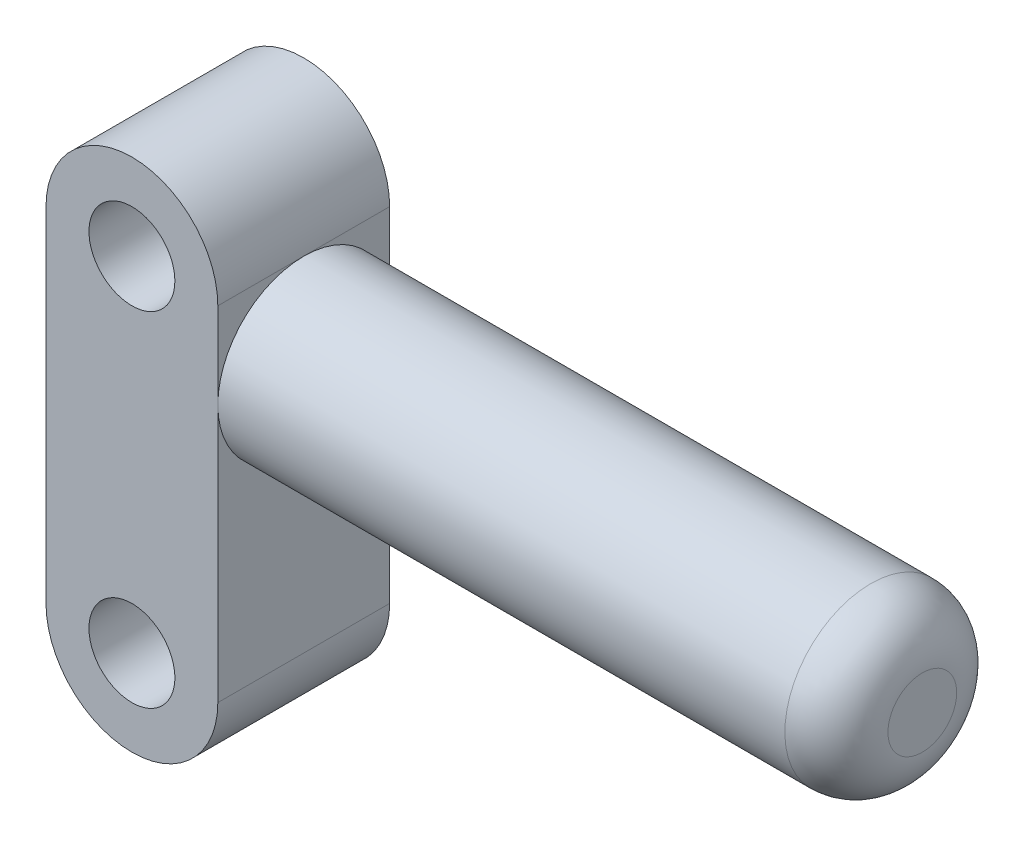
ISO-10303-21;
HEADER;
FILE_DESCRIPTION(('STEP AP214'),'2;1');
FILE_NAME('part.step','',(''),(''),'','','');
FILE_SCHEMA(('AUTOMOTIVE_DESIGN { 1 0 10303 214 1 1 1 1 }'));
ENDSEC;
DATA;
#1=APPLICATION_CONTEXT('core data for automotive mechanical design processes');
#2=APPLICATION_PROTOCOL_DEFINITION('international standard','automotive_design',2000,#1);
#3=PRODUCT_CONTEXT('',#1,'mechanical');
#4=PRODUCT('Part','Part','',(#3));
#5=PRODUCT_RELATED_PRODUCT_CATEGORY('part','',(#4));
#6=PRODUCT_DEFINITION_FORMATION('','',#4);
#7=PRODUCT_DEFINITION_CONTEXT('part definition',#1,'design');
#8=PRODUCT_DEFINITION('design','',#6,#7);
#9=PRODUCT_DEFINITION_SHAPE('','',#8);
#10=(LENGTH_UNIT() NAMED_UNIT(*) SI_UNIT(.MILLI.,.METRE.));
#11=(NAMED_UNIT(*) PLANE_ANGLE_UNIT() SI_UNIT($,.RADIAN.));
#12=(NAMED_UNIT(*) SI_UNIT($,.STERADIAN.) SOLID_ANGLE_UNIT());
#13=UNCERTAINTY_MEASURE_WITH_UNIT(LENGTH_MEASURE(1.E-05),#10,'distance_accuracy_value','');
#14=(GEOMETRIC_REPRESENTATION_CONTEXT(3) GLOBAL_UNCERTAINTY_ASSIGNED_CONTEXT((#13)) GLOBAL_UNIT_ASSIGNED_CONTEXT((#10,
#11,#12)) REPRESENTATION_CONTEXT('',''));
#15=CARTESIAN_POINT('',(0.,0.,0.));
#16=DIRECTION('',(0.,0.,1.));
#17=DIRECTION('',(1.,0.,0.));
#18=AXIS2_PLACEMENT_3D('',#15,#16,#17);
#19=CARTESIAN_POINT('',(5.,10.,5.));
#20=DIRECTION('',(-1.,0.,0.));
#21=DIRECTION('',(0.,-1.,0.));
#22=AXIS2_PLACEMENT_3D('',#19,#20,#21);
#23=PLANE('',#22);
#24=CARTESIAN_POINT('',(5.,5.,0.));
#25=DIRECTION('',(-1.,0.,0.));
#26=DIRECTION('',(0.,-1.,0.));
#27=AXIS2_PLACEMENT_3D('',#24,#25,#26);
#28=CIRCLE('',#27,5.);
#29=CARTESIAN_POINT('',(5.,5.,-5.));
#30=VERTEX_POINT('',#29);
#31=CARTESIAN_POINT('',(5.,10.,0.));
#32=VERTEX_POINT('',#31);
#33=EDGE_CURVE('E107',#30,#32,#28,.F.);
#34=ORIENTED_EDGE('',*,*,#33,.F.);
#35=DIRECTION('',(0.,1.,0.));
#36=VECTOR('',#35,1.);
#37=CARTESIAN_POINT('',(5.,10.,-5.));
#38=LINE('',#37,#36);
#39=CARTESIAN_POINT('',(5.,10.,-5.));
#40=VERTEX_POINT('',#39);
#41=EDGE_CURVE('E95',#30,#40,#38,.T.);
#42=ORIENTED_EDGE('',*,*,#41,.T.);
#43=DIRECTION('',(0.,0.,-1.));
#44=VECTOR('',#43,1.);
#45=CARTESIAN_POINT('',(5.,10.,5.));
#46=LINE('',#45,#44);
#47=EDGE_CURVE('E108',#32,#40,#46,.T.);
#48=ORIENTED_EDGE('',*,*,#47,.F.);
#49=EDGE_LOOP('',(#34,#42,#48));
#50=FACE_BOUND('',#49,.T.);
#51=ADVANCED_FACE('F36',(#50),#23,.F.);
#52=CARTESIAN_POINT('',(5.,5.,0.));
#53=DIRECTION('',(1.,0.,0.));
#54=DIRECTION('',(0.,1.,0.));
#55=AXIS2_PLACEMENT_3D('',#52,#53,#54);
#56=CIRCLE('',#55,5.);
#57=CARTESIAN_POINT('',(5.,5.,5.));
#58=VERTEX_POINT('',#57);
#59=EDGE_CURVE('E58',#32,#58,#56,.T.);
#60=ORIENTED_EDGE('',*,*,#59,.F.);
#61=CARTESIAN_POINT('',(5.,10.,5.));
#62=VERTEX_POINT('',#61);
#63=EDGE_CURVE('E176',#62,#32,#46,.T.);
#64=ORIENTED_EDGE('',*,*,#63,.F.);
#65=DIRECTION('',(0.,1.,0.));
#66=VECTOR('',#65,1.);
#67=CARTESIAN_POINT('',(5.,10.,5.));
#68=LINE('',#67,#66);
#69=EDGE_CURVE('E188',#58,#62,#68,.T.);
#70=ORIENTED_EDGE('',*,*,#69,.F.);
#71=EDGE_LOOP('',(#60,#64,#70));
#72=FACE_BOUND('',#71,.T.);
#73=ADVANCED_FACE('F131',(#72),#23,.F.);
#74=CARTESIAN_POINT('',(0.,10.,5.));
#75=DIRECTION('',(0.,0.,1.));
#76=DIRECTION('',(1.,0.,0.));
#77=AXIS2_PLACEMENT_3D('',#74,#75,#76);
#78=PLANE('',#77);
#79=CARTESIAN_POINT('',(0.,10.,5.));
#80=DIRECTION('',(0.,0.,1.));
#81=DIRECTION('',(1.,0.,0.));
#82=AXIS2_PLACEMENT_3D('',#79,#80,#81);
#83=CIRCLE('',#82,2.5);
#84=CARTESIAN_POINT('',(2.5,10.,5.));
#85=VERTEX_POINT('',#84);
#86=EDGE_CURVE('E165',#85,#85,#83,.T.);
#87=ORIENTED_EDGE('',*,*,#86,.F.);
#88=EDGE_LOOP('',(#87));
#89=FACE_BOUND('',#88,.T.);
#90=CARTESIAN_POINT('',(0.,10.,5.));
#91=DIRECTION('',(0.,0.,1.));
#92=DIRECTION('',(1.,0.,0.));
#93=AXIS2_PLACEMENT_3D('',#90,#91,#92);
#94=CIRCLE('',#93,5.);
#95=CARTESIAN_POINT('',(-5.,10.,5.));
#96=VERTEX_POINT('',#95);
#97=EDGE_CURVE('E94',#62,#96,#94,.T.);
#98=ORIENTED_EDGE('',*,*,#97,.T.);
#99=DIRECTION('',(0.,-1.,0.));
#100=VECTOR('',#99,1.);
#101=CARTESIAN_POINT('',(-5.,10.,5.));
#102=LINE('',#101,#100);
#103=CARTESIAN_POINT('',(-4.99999999999999,-10.,5.));
#104=VERTEX_POINT('',#103);
#105=EDGE_CURVE('E182',#96,#104,#102,.T.);
#106=ORIENTED_EDGE('',*,*,#105,.T.);
#107=CARTESIAN_POINT('',(0.,-10.,5.));
#108=DIRECTION('',(0.,0.,1.));
#109=DIRECTION('',(1.,0.,0.));
#110=AXIS2_PLACEMENT_3D('',#107,#108,#109);
#111=CIRCLE('',#110,5.);
#112=CARTESIAN_POINT('',(5.,-10.,5.));
#113=VERTEX_POINT('',#112);
#114=EDGE_CURVE('E181',#104,#113,#111,.T.);
#115=ORIENTED_EDGE('',*,*,#114,.T.);
#116=EDGE_CURVE('E172',#113,#58,#68,.T.);
#117=ORIENTED_EDGE('',*,*,#116,.T.);
#118=ORIENTED_EDGE('',*,*,#69,.T.);
#119=EDGE_LOOP('',(#98,#106,#115,#117,#118));
#120=FACE_BOUND('',#119,.T.);
#121=CARTESIAN_POINT('',(0.,-10.,5.));
#122=DIRECTION('',(0.,0.,1.));
#123=DIRECTION('',(-1.,0.,0.));
#124=AXIS2_PLACEMENT_3D('',#121,#122,#123);
#125=CIRCLE('',#124,2.5);
#126=CARTESIAN_POINT('',(-2.5,-10.,5.));
#127=VERTEX_POINT('',#126);
#128=EDGE_CURVE('E192',#127,#127,#125,.T.);
#129=ORIENTED_EDGE('',*,*,#128,.F.);
#130=EDGE_LOOP('',(#129));
#131=FACE_BOUND('',#130,.T.);
#132=ADVANCED_FACE('F136',(#89,#120,#131),#78,.T.);
#133=CARTESIAN_POINT('',(0.,10.,-5.));
#134=DIRECTION('',(0.,0.,1.));
#135=DIRECTION('',(1.,0.,0.));
#136=AXIS2_PLACEMENT_3D('',#133,#134,#135);
#137=PLANE('',#136);
#138=CARTESIAN_POINT('',(0.,10.,-5.));
#139=DIRECTION('',(0.,0.,1.));
#140=DIRECTION('',(1.,0.,0.));
#141=AXIS2_PLACEMENT_3D('',#138,#139,#140);
#142=CIRCLE('',#141,5.);
#143=CARTESIAN_POINT('',(-5.,10.,-5.));
#144=VERTEX_POINT('',#143);
#145=EDGE_CURVE('E103',#40,#144,#142,.T.);
#146=ORIENTED_EDGE('',*,*,#145,.F.);
#147=ORIENTED_EDGE('',*,*,#41,.F.);
#148=CARTESIAN_POINT('',(5.,-10.,-5.));
#149=VERTEX_POINT('',#148);
#150=EDGE_CURVE('E87',#149,#30,#38,.T.);
#151=ORIENTED_EDGE('',*,*,#150,.F.);
#152=CARTESIAN_POINT('',(0.,-10.,-5.));
#153=DIRECTION('',(0.,0.,1.));
#154=DIRECTION('',(1.,0.,0.));
#155=AXIS2_PLACEMENT_3D('',#152,#153,#154);
#156=CIRCLE('',#155,5.);
#157=CARTESIAN_POINT('',(-4.99999999999999,-10.,-5.));
#158=VERTEX_POINT('',#157);
#159=EDGE_CURVE('E105',#158,#149,#156,.T.);
#160=ORIENTED_EDGE('',*,*,#159,.F.);
#161=DIRECTION('',(0.,-1.,0.));
#162=VECTOR('',#161,1.);
#163=CARTESIAN_POINT('',(-5.,10.,-5.));
#164=LINE('',#163,#162);
#165=EDGE_CURVE('E164',#144,#158,#164,.T.);
#166=ORIENTED_EDGE('',*,*,#165,.F.);
#167=EDGE_LOOP('',(#146,#147,#151,#160,#166));
#168=FACE_BOUND('',#167,.T.);
#169=CARTESIAN_POINT('',(0.,10.,-5.));
#170=DIRECTION('',(0.,0.,1.));
#171=DIRECTION('',(1.,0.,0.));
#172=AXIS2_PLACEMENT_3D('',#169,#170,#171);
#173=CIRCLE('',#172,2.5);
#174=CARTESIAN_POINT('',(2.5,10.,-5.));
#175=VERTEX_POINT('',#174);
#176=EDGE_CURVE('E169',#175,#175,#173,.T.);
#177=ORIENTED_EDGE('',*,*,#176,.T.);
#178=EDGE_LOOP('',(#177));
#179=FACE_BOUND('',#178,.T.);
#180=CARTESIAN_POINT('',(0.,-10.,-5.));
#181=DIRECTION('',(0.,0.,1.));
#182=DIRECTION('',(-1.,0.,0.));
#183=AXIS2_PLACEMENT_3D('',#180,#181,#182);
#184=CIRCLE('',#183,2.5);
#185=CARTESIAN_POINT('',(-2.5,-10.,-5.));
#186=VERTEX_POINT('',#185);
#187=EDGE_CURVE('E194',#186,#186,#184,.T.);
#188=ORIENTED_EDGE('',*,*,#187,.T.);
#189=EDGE_LOOP('',(#188));
#190=FACE_BOUND('',#189,.T.);
#191=ADVANCED_FACE('F100',(#168,#179,#190),#137,.F.);
#192=CARTESIAN_POINT('',(0.,10.,5.));
#193=DIRECTION('',(0.,0.,-1.));
#194=DIRECTION('',(-1.,0.,0.));
#195=AXIS2_PLACEMENT_3D('',#192,#193,#194);
#196=CYLINDRICAL_SURFACE('',#195,5.);
#197=ORIENTED_EDGE('',*,*,#145,.T.);
#198=DIRECTION('',(0.,0.,-1.));
#199=VECTOR('',#198,1.);
#200=CARTESIAN_POINT('',(-5.,10.,5.));
#201=LINE('',#200,#199);
#202=EDGE_CURVE('E113',#96,#144,#201,.T.);
#203=ORIENTED_EDGE('',*,*,#202,.F.);
#204=ORIENTED_EDGE('',*,*,#97,.F.);
#205=ORIENTED_EDGE('',*,*,#63,.T.);
#206=ORIENTED_EDGE('',*,*,#47,.T.);
#207=EDGE_LOOP('',(#197,#203,#204,#205,#206));
#208=FACE_BOUND('',#207,.T.);
#209=ADVANCED_FACE('F154',(#208),#196,.T.);
#210=CARTESIAN_POINT('',(-5.,10.,5.));
#211=DIRECTION('',(1.,0.,0.));
#212=DIRECTION('',(0.,1.,0.));
#213=AXIS2_PLACEMENT_3D('',#210,#211,#212);
#214=PLANE('',#213);
#215=ORIENTED_EDGE('',*,*,#165,.T.);
#216=DIRECTION('',(0.,0.,-1.));
#217=VECTOR('',#216,1.);
#218=CARTESIAN_POINT('',(-4.99999999999999,-10.,5.));
#219=LINE('',#218,#217);
#220=EDGE_CURVE('E115',#104,#158,#219,.T.);
#221=ORIENTED_EDGE('',*,*,#220,.F.);
#222=ORIENTED_EDGE('',*,*,#105,.F.);
#223=ORIENTED_EDGE('',*,*,#202,.T.);
#224=EDGE_LOOP('',(#215,#221,#222,#223));
#225=FACE_BOUND('',#224,.T.);
#226=ADVANCED_FACE('F149',(#225),#214,.F.);
#227=CARTESIAN_POINT('',(0.,-10.,5.));
#228=DIRECTION('',(0.,0.,-1.));
#229=DIRECTION('',(-1.,0.,0.));
#230=AXIS2_PLACEMENT_3D('',#227,#228,#229);
#231=CYLINDRICAL_SURFACE('',#230,5.);
#232=ORIENTED_EDGE('',*,*,#159,.T.);
#233=DIRECTION('',(0.,0.,-1.));
#234=VECTOR('',#233,1.);
#235=CARTESIAN_POINT('',(5.,-10.,5.));
#236=LINE('',#235,#234);
#237=EDGE_CURVE('E91',#113,#149,#236,.T.);
#238=ORIENTED_EDGE('',*,*,#237,.F.);
#239=ORIENTED_EDGE('',*,*,#114,.F.);
#240=ORIENTED_EDGE('',*,*,#220,.T.);
#241=EDGE_LOOP('',(#232,#238,#239,#240));
#242=FACE_BOUND('',#241,.T.);
#243=ADVANCED_FACE('F141',(#242),#231,.T.);
#244=EDGE_CURVE('E51',#58,#30,#28,.F.);
#245=ORIENTED_EDGE('',*,*,#244,.F.);
#246=ORIENTED_EDGE('',*,*,#116,.F.);
#247=ORIENTED_EDGE('',*,*,#237,.T.);
#248=ORIENTED_EDGE('',*,*,#150,.T.);
#249=EDGE_LOOP('',(#245,#246,#247,#248));
#250=FACE_BOUND('',#249,.T.);
#251=ADVANCED_FACE('F89',(#250),#23,.F.);
#252=CARTESIAN_POINT('',(0.,10.,5.));
#253=DIRECTION('',(0.,0.,-1.));
#254=DIRECTION('',(-1.,0.,0.));
#255=AXIS2_PLACEMENT_3D('',#252,#253,#254);
#256=CYLINDRICAL_SURFACE('',#255,2.5);
#257=ORIENTED_EDGE('',*,*,#86,.T.);
#258=EDGE_LOOP('',(#257));
#259=FACE_BOUND('',#258,.T.);
#260=ORIENTED_EDGE('',*,*,#176,.F.);
#261=EDGE_LOOP('',(#260));
#262=FACE_BOUND('',#261,.T.);
#263=ADVANCED_FACE('F140',(#259,#262),#256,.F.);
#264=CARTESIAN_POINT('',(0.,-10.,5.));
#265=DIRECTION('',(0.,0.,-1.));
#266=DIRECTION('',(-1.,0.,0.));
#267=AXIS2_PLACEMENT_3D('',#264,#265,#266);
#268=CYLINDRICAL_SURFACE('',#267,2.5);
#269=ORIENTED_EDGE('',*,*,#128,.T.);
#270=EDGE_LOOP('',(#269));
#271=FACE_BOUND('',#270,.T.);
#272=ORIENTED_EDGE('',*,*,#187,.F.);
#273=EDGE_LOOP('',(#272));
#274=FACE_BOUND('',#273,.T.);
#275=ADVANCED_FACE('F146',(#271,#274),#268,.F.);
#276=CARTESIAN_POINT('',(41.,5.00000000000001,0.));
#277=DIRECTION('',(-1.,0.,0.));
#278=DIRECTION('',(0.,-1.,0.));
#279=AXIS2_PLACEMENT_3D('',#276,#277,#278);
#280=CYLINDRICAL_SURFACE('',#279,5.);
#281=CARTESIAN_POINT('',(38.,5.00000000000001,0.));
#282=DIRECTION('',(1.,0.,0.));
#283=DIRECTION('',(0.,1.,0.));
#284=AXIS2_PLACEMENT_3D('',#281,#282,#283);
#285=CIRCLE('',#284,5.);
#286=CARTESIAN_POINT('',(38.,10.,0.));
#287=VERTEX_POINT('',#286);
#288=EDGE_CURVE('E11',#287,#287,#285,.F.);
#289=ORIENTED_EDGE('',*,*,#288,.T.);
#290=EDGE_LOOP('',(#289));
#291=FACE_BOUND('',#290,.T.);
#292=ORIENTED_EDGE('',*,*,#59,.T.);
#293=ORIENTED_EDGE('',*,*,#244,.T.);
#294=ORIENTED_EDGE('',*,*,#33,.T.);
#295=EDGE_LOOP('',(#292,#293,#294));
#296=FACE_BOUND('',#295,.T.);
#297=ADVANCED_FACE('F112',(#291,#296),#280,.T.);
#298=CARTESIAN_POINT('',(41.,5.00000000000001,0.));
#299=DIRECTION('',(1.,0.,0.));
#300=DIRECTION('',(0.,1.,0.));
#301=AXIS2_PLACEMENT_3D('',#298,#299,#300);
#302=PLANE('',#301);
#303=CARTESIAN_POINT('',(41.,5.00000000000001,0.));
#304=DIRECTION('',(1.,0.,0.));
#305=DIRECTION('',(0.,1.,0.));
#306=AXIS2_PLACEMENT_3D('',#303,#304,#305);
#307=CIRCLE('',#306,2.);
#308=CARTESIAN_POINT('',(41.,7.00000000000001,0.));
#309=VERTEX_POINT('',#308);
#310=EDGE_CURVE('E44',#309,#309,#307,.T.);
#311=ORIENTED_EDGE('',*,*,#310,.T.);
#312=EDGE_LOOP('',(#311));
#313=FACE_BOUND('',#312,.T.);
#314=ADVANCED_FACE('F121',(#313),#302,.T.);
#315=CARTESIAN_POINT('',(38.,5.00000000000001,0.));
#316=DIRECTION('',(1.,0.,0.));
#317=DIRECTION('',(0.,1.,0.));
#318=AXIS2_PLACEMENT_3D('',#315,#316,#317);
#319=DEGENERATE_TOROIDAL_SURFACE('',#318,2.,3.,.T.);
#320=ORIENTED_EDGE('',*,*,#288,.F.);
#321=EDGE_LOOP('',(#320));
#322=FACE_BOUND('',#321,.T.);
#323=ORIENTED_EDGE('',*,*,#310,.F.);
#324=EDGE_LOOP('',(#323));
#325=FACE_BOUND('',#324,.T.);
#326=ADVANCED_FACE('F38',(#322,#325),#319,.T.);
#327=CLOSED_SHELL('',(#51,#73,#132,#191,#209,#226,#243,#251,#263,#275,#297,#314,#326));
#328=MANIFOLD_SOLID_BREP('B2',#327);
#329=ADVANCED_BREP_SHAPE_REPRESENTATION('',(#18,#328),#14);
#330=SHAPE_DEFINITION_REPRESENTATION(#9,#329);
ENDSEC;
END-ISO-10303-21;
